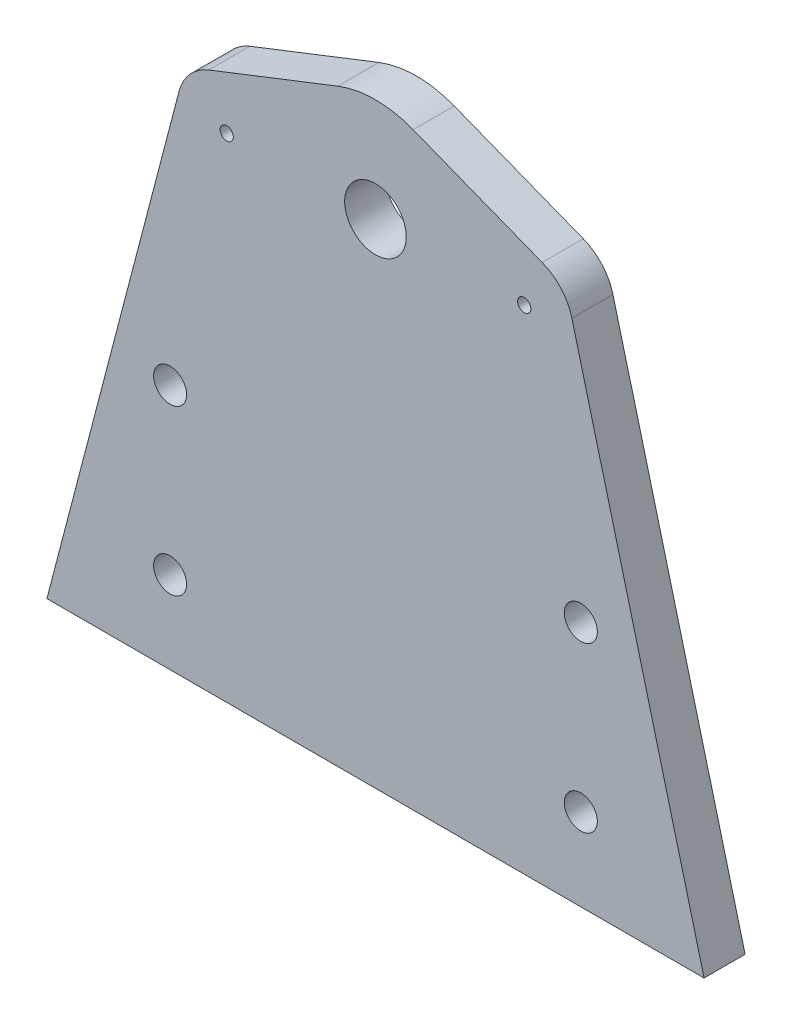
ISO-10303-21;
HEADER;
FILE_DESCRIPTION(('STEP AP214'),'2;1');
FILE_NAME('part.step','',(''),(''),'','','');
FILE_SCHEMA(('AUTOMOTIVE_DESIGN { 1 0 10303 214 1 1 1 1 }'));
ENDSEC;
DATA;
#1=APPLICATION_CONTEXT('core data for automotive mechanical design processes');
#2=APPLICATION_PROTOCOL_DEFINITION('international standard','automotive_design',2000,#1);
#3=PRODUCT_CONTEXT('',#1,'mechanical');
#4=PRODUCT('Part','Part','',(#3));
#5=PRODUCT_RELATED_PRODUCT_CATEGORY('part','',(#4));
#6=PRODUCT_DEFINITION_FORMATION('','',#4);
#7=PRODUCT_DEFINITION_CONTEXT('part definition',#1,'design');
#8=PRODUCT_DEFINITION('design','',#6,#7);
#9=PRODUCT_DEFINITION_SHAPE('','',#8);
#10=(LENGTH_UNIT() NAMED_UNIT(*) SI_UNIT(.MILLI.,.METRE.));
#11=(NAMED_UNIT(*) PLANE_ANGLE_UNIT() SI_UNIT($,.RADIAN.));
#12=(NAMED_UNIT(*) SI_UNIT($,.STERADIAN.) SOLID_ANGLE_UNIT());
#13=UNCERTAINTY_MEASURE_WITH_UNIT(LENGTH_MEASURE(1.E-05),#10,'distance_accuracy_value','');
#14=(GEOMETRIC_REPRESENTATION_CONTEXT(3) GLOBAL_UNCERTAINTY_ASSIGNED_CONTEXT((#13)) GLOBAL_UNIT_ASSIGNED_CONTEXT((#10,
#11,#12)) REPRESENTATION_CONTEXT('',''));
#15=CARTESIAN_POINT('',(0.,0.,0.));
#16=DIRECTION('',(0.,0.,1.));
#17=DIRECTION('',(1.,0.,0.));
#18=AXIS2_PLACEMENT_3D('',#15,#16,#17);
#19=CARTESIAN_POINT('',(0.,0.,6.35));
#20=DIRECTION('',(0.,0.,-1.));
#21=DIRECTION('',(-1.,0.,0.));
#22=AXIS2_PLACEMENT_3D('',#19,#20,#21);
#23=PLANE('',#22);
#24=CARTESIAN_POINT('',(-31.75,-38.1,6.35));
#25=DIRECTION('',(0.,0.,1.));
#26=DIRECTION('',(1.,0.,0.));
#27=AXIS2_PLACEMENT_3D('',#24,#25,#26);
#28=CIRCLE('',#27,2.5527);
#29=CARTESIAN_POINT('',(-29.1973,-38.1,6.35));
#30=VERTEX_POINT('',#29);
#31=EDGE_CURVE('E221',#30,#30,#28,.T.);
#32=ORIENTED_EDGE('',*,*,#31,.F.);
#33=EDGE_LOOP('',(#32));
#34=FACE_BOUND('',#33,.T.);
#35=CARTESIAN_POINT('',(0.,0.,6.35));
#36=DIRECTION('',(0.,0.,1.));
#37=DIRECTION('',(1.,0.,0.));
#38=AXIS2_PLACEMENT_3D('',#35,#36,#37);
#39=CIRCLE('',#38,4.7625);
#40=CARTESIAN_POINT('',(4.7625,0.,6.35));
#41=VERTEX_POINT('',#40);
#42=EDGE_CURVE('E138',#41,#41,#39,.T.);
#43=ORIENTED_EDGE('',*,*,#42,.F.);
#44=EDGE_LOOP('',(#43));
#45=FACE_BOUND('',#44,.T.);
#46=CARTESIAN_POINT('',(0.,0.,6.35));
#47=DIRECTION('',(0.,0.,1.));
#48=DIRECTION('',(-1.,0.,0.));
#49=AXIS2_PLACEMENT_3D('',#46,#47,#48);
#50=CIRCLE('',#49,16.);
#51=CARTESIAN_POINT('',(5.82956522398125,14.9002070220299,6.35));
#52=VERTEX_POINT('',#51);
#53=CARTESIAN_POINT('',(-5.82956522398125,14.9002070220299,6.35));
#54=VERTEX_POINT('',#53);
#55=EDGE_CURVE('E149',#52,#54,#50,.T.);
#56=ORIENTED_EDGE('',*,*,#55,.T.);
#57=DIRECTION('',(-0.931262938876867,-0.364347826498828,0.));
#58=VECTOR('',#57,1.);
#59=CARTESIAN_POINT('',(-25.7763304119211,7.09622359424173,6.35));
#60=LINE('',#59,#58);
#61=CARTESIAN_POINT('',(-25.7763304119211,7.09622359424173,6.35));
#62=VERTEX_POINT('',#61);
#63=EDGE_CURVE('E97',#54,#62,#60,.T.);
#64=ORIENTED_EDGE('',*,*,#63,.T.);
#65=CARTESIAN_POINT('',(-22.999999974,0.,6.35));
#66=DIRECTION('',(0.,0.,1.));
#67=DIRECTION('',(1.,0.,0.));
#68=AXIS2_PLACEMENT_3D('',#65,#66,#67);
#69=CIRCLE('',#68,7.62);
#70=CARTESIAN_POINT('',(-30.3721655240328,1.92758270974527,6.35));
#71=VERTEX_POINT('',#70);
#72=EDGE_CURVE('E164',#62,#71,#69,.T.);
#73=ORIENTED_EDGE('',*,*,#72,.T.);
#74=DIRECTION('',(-0.252963610202791,-0.967475793967565,0.));
#75=VECTOR('',#74,1.);
#76=CARTESIAN_POINT('',(-30.3721655240328,1.92758270974527,6.35));
#77=LINE('',#76,#75);
#78=CARTESIAN_POINT('',(-50.8,-76.2,6.35));
#79=VERTEX_POINT('',#78);
#80=EDGE_CURVE('E177',#71,#79,#77,.T.);
#81=ORIENTED_EDGE('',*,*,#80,.T.);
#82=DIRECTION('',(1.,0.,0.));
#83=VECTOR('',#82,1.);
#84=CARTESIAN_POINT('',(-50.8,-76.2,6.35));
#85=LINE('',#84,#83);
#86=CARTESIAN_POINT('',(50.8,-76.2,6.35));
#87=VERTEX_POINT('',#86);
#88=EDGE_CURVE('E116',#79,#87,#85,.T.);
#89=ORIENTED_EDGE('',*,*,#88,.T.);
#90=DIRECTION('',(-0.252963610202791,0.967475793967565,0.));
#91=VECTOR('',#90,1.);
#92=CARTESIAN_POINT('',(30.3721655240328,1.92758270974527,6.35));
#93=LINE('',#92,#91);
#94=CARTESIAN_POINT('',(30.3721655240328,1.92758270974527,6.35));
#95=VERTEX_POINT('',#94);
#96=EDGE_CURVE('E110',#87,#95,#93,.T.);
#97=ORIENTED_EDGE('',*,*,#96,.T.);
#98=CARTESIAN_POINT('',(22.999999974,0.,6.35));
#99=DIRECTION('',(0.,0.,1.));
#100=DIRECTION('',(-1.,0.,0.));
#101=AXIS2_PLACEMENT_3D('',#98,#99,#100);
#102=CIRCLE('',#101,7.62);
#103=CARTESIAN_POINT('',(25.7763304119211,7.09622359424172,6.35));
#104=VERTEX_POINT('',#103);
#105=EDGE_CURVE('E114',#95,#104,#102,.T.);
#106=ORIENTED_EDGE('',*,*,#105,.T.);
#107=DIRECTION('',(-0.931262938876867,0.364347826498828,0.));
#108=VECTOR('',#107,1.);
#109=CARTESIAN_POINT('',(5.82956522398125,14.9002070220299,6.35));
#110=LINE('',#109,#108);
#111=EDGE_CURVE('E54',#104,#52,#110,.T.);
#112=ORIENTED_EDGE('',*,*,#111,.T.);
#113=EDGE_LOOP('',(#56,#64,#73,#81,#89,#97,#106,#112));
#114=FACE_BOUND('',#113,.T.);
#115=CARTESIAN_POINT('',(-22.999999974,0.,6.35));
#116=DIRECTION('',(0.,0.,-1.));
#117=DIRECTION('',(-1.,0.,0.));
#118=AXIS2_PLACEMENT_3D('',#115,#116,#117);
#119=CIRCLE('',#118,1.025);
#120=CARTESIAN_POINT('',(-24.024999974,0.,6.35));
#121=VERTEX_POINT('',#120);
#122=EDGE_CURVE('E186',#121,#121,#119,.T.);
#123=ORIENTED_EDGE('',*,*,#122,.T.);
#124=EDGE_LOOP('',(#123));
#125=FACE_BOUND('',#124,.T.);
#126=CARTESIAN_POINT('',(22.999999974,0.,6.35));
#127=DIRECTION('',(0.,0.,-1.));
#128=DIRECTION('',(-1.,0.,0.));
#129=AXIS2_PLACEMENT_3D('',#126,#127,#128);
#130=CIRCLE('',#129,1.025);
#131=CARTESIAN_POINT('',(21.974999974,0.,6.35));
#132=VERTEX_POINT('',#131);
#133=EDGE_CURVE('E194',#132,#132,#130,.T.);
#134=ORIENTED_EDGE('',*,*,#133,.T.);
#135=EDGE_LOOP('',(#134));
#136=FACE_BOUND('',#135,.T.);
#137=CARTESIAN_POINT('',(31.75,-38.1,6.35));
#138=DIRECTION('',(0.,0.,1.));
#139=DIRECTION('',(1.,0.,0.));
#140=AXIS2_PLACEMENT_3D('',#137,#138,#139);
#141=CIRCLE('',#140,2.5527);
#142=CARTESIAN_POINT('',(34.3027,-38.1,6.35));
#143=VERTEX_POINT('',#142);
#144=EDGE_CURVE('E203',#143,#143,#141,.T.);
#145=ORIENTED_EDGE('',*,*,#144,.F.);
#146=EDGE_LOOP('',(#145));
#147=FACE_BOUND('',#146,.T.);
#148=CARTESIAN_POINT('',(31.75,-63.5,6.35));
#149=DIRECTION('',(0.,0.,1.));
#150=DIRECTION('',(1.,0.,0.));
#151=AXIS2_PLACEMENT_3D('',#148,#149,#150);
#152=CIRCLE('',#151,2.5527);
#153=CARTESIAN_POINT('',(34.3027,-63.5,6.35));
#154=VERTEX_POINT('',#153);
#155=EDGE_CURVE('E209',#154,#154,#152,.T.);
#156=ORIENTED_EDGE('',*,*,#155,.F.);
#157=EDGE_LOOP('',(#156));
#158=FACE_BOUND('',#157,.T.);
#159=CARTESIAN_POINT('',(-31.75,-63.5,6.35));
#160=DIRECTION('',(0.,0.,1.));
#161=DIRECTION('',(1.,0.,0.));
#162=AXIS2_PLACEMENT_3D('',#159,#160,#161);
#163=CIRCLE('',#162,2.5527);
#164=CARTESIAN_POINT('',(-29.1973,-63.5,6.35));
#165=VERTEX_POINT('',#164);
#166=EDGE_CURVE('E215',#165,#165,#163,.T.);
#167=ORIENTED_EDGE('',*,*,#166,.F.);
#168=EDGE_LOOP('',(#167));
#169=FACE_BOUND('',#168,.T.);
#170=ADVANCED_FACE('F37',(#34,#45,#114,#125,#136,#147,#158,#169),#23,.F.);
#171=CARTESIAN_POINT('',(0.,0.,0.));
#172=DIRECTION('',(0.,0.,-1.));
#173=DIRECTION('',(-1.,0.,0.));
#174=AXIS2_PLACEMENT_3D('',#171,#172,#173);
#175=PLANE('',#174);
#176=CARTESIAN_POINT('',(-31.75,-38.1,0.));
#177=DIRECTION('',(0.,0.,1.));
#178=DIRECTION('',(1.,0.,0.));
#179=AXIS2_PLACEMENT_3D('',#176,#177,#178);
#180=CIRCLE('',#179,2.5527);
#181=CARTESIAN_POINT('',(-29.1973,-38.1,0.));
#182=VERTEX_POINT('',#181);
#183=EDGE_CURVE('E218',#182,#182,#180,.T.);
#184=ORIENTED_EDGE('',*,*,#183,.T.);
#185=EDGE_LOOP('',(#184));
#186=FACE_BOUND('',#185,.T.);
#187=CARTESIAN_POINT('',(0.,0.,0.));
#188=DIRECTION('',(0.,0.,1.));
#189=DIRECTION('',(1.,0.,0.));
#190=AXIS2_PLACEMENT_3D('',#187,#188,#189);
#191=CIRCLE('',#190,4.7625);
#192=CARTESIAN_POINT('',(4.7625,0.,0.));
#193=VERTEX_POINT('',#192);
#194=EDGE_CURVE('E183',#193,#193,#191,.T.);
#195=ORIENTED_EDGE('',*,*,#194,.T.);
#196=EDGE_LOOP('',(#195));
#197=FACE_BOUND('',#196,.T.);
#198=CARTESIAN_POINT('',(0.,0.,0.));
#199=DIRECTION('',(0.,0.,1.));
#200=DIRECTION('',(-1.,0.,0.));
#201=AXIS2_PLACEMENT_3D('',#198,#199,#200);
#202=CIRCLE('',#201,16.);
#203=CARTESIAN_POINT('',(5.82956522398125,14.9002070220299,0.));
#204=VERTEX_POINT('',#203);
#205=CARTESIAN_POINT('',(-5.82956522398125,14.9002070220299,0.));
#206=VERTEX_POINT('',#205);
#207=EDGE_CURVE('E134',#204,#206,#202,.T.);
#208=ORIENTED_EDGE('',*,*,#207,.F.);
#209=DIRECTION('',(-0.931262938876867,0.364347826498828,0.));
#210=VECTOR('',#209,1.);
#211=CARTESIAN_POINT('',(5.82956522398125,14.9002070220299,0.));
#212=LINE('',#211,#210);
#213=CARTESIAN_POINT('',(25.7763304119211,7.09622359424172,0.));
#214=VERTEX_POINT('',#213);
#215=EDGE_CURVE('E89',#214,#204,#212,.T.);
#216=ORIENTED_EDGE('',*,*,#215,.F.);
#217=CARTESIAN_POINT('',(22.999999974,0.,0.));
#218=DIRECTION('',(0.,0.,1.));
#219=DIRECTION('',(-1.,0.,0.));
#220=AXIS2_PLACEMENT_3D('',#217,#218,#219);
#221=CIRCLE('',#220,7.62);
#222=CARTESIAN_POINT('',(30.3721655240328,1.92758270974527,0.));
#223=VERTEX_POINT('',#222);
#224=EDGE_CURVE('E83',#223,#214,#221,.T.);
#225=ORIENTED_EDGE('',*,*,#224,.F.);
#226=DIRECTION('',(-0.252963610202791,0.967475793967565,0.));
#227=VECTOR('',#226,1.);
#228=CARTESIAN_POINT('',(30.3721655240328,1.92758270974527,0.));
#229=LINE('',#228,#227);
#230=CARTESIAN_POINT('',(50.8,-76.2,0.));
#231=VERTEX_POINT('',#230);
#232=EDGE_CURVE('E124',#231,#223,#229,.T.);
#233=ORIENTED_EDGE('',*,*,#232,.F.);
#234=DIRECTION('',(1.,0.,0.));
#235=VECTOR('',#234,1.);
#236=CARTESIAN_POINT('',(-50.8,-76.2,0.));
#237=LINE('',#236,#235);
#238=CARTESIAN_POINT('',(-50.8,-76.2,0.));
#239=VERTEX_POINT('',#238);
#240=EDGE_CURVE('E144',#239,#231,#237,.T.);
#241=ORIENTED_EDGE('',*,*,#240,.F.);
#242=DIRECTION('',(-0.252963610202791,-0.967475793967565,0.));
#243=VECTOR('',#242,1.);
#244=CARTESIAN_POINT('',(-30.3721655240328,1.92758270974527,0.));
#245=LINE('',#244,#243);
#246=CARTESIAN_POINT('',(-30.3721655240328,1.92758270974527,0.));
#247=VERTEX_POINT('',#246);
#248=EDGE_CURVE('E142',#247,#239,#245,.T.);
#249=ORIENTED_EDGE('',*,*,#248,.F.);
#250=CARTESIAN_POINT('',(-22.999999974,0.,0.));
#251=DIRECTION('',(0.,0.,1.));
#252=DIRECTION('',(1.,0.,0.));
#253=AXIS2_PLACEMENT_3D('',#250,#251,#252);
#254=CIRCLE('',#253,7.62);
#255=CARTESIAN_POINT('',(-25.7763304119211,7.09622359424173,0.));
#256=VERTEX_POINT('',#255);
#257=EDGE_CURVE('E140',#256,#247,#254,.T.);
#258=ORIENTED_EDGE('',*,*,#257,.F.);
#259=DIRECTION('',(-0.931262938876867,-0.364347826498828,0.));
#260=VECTOR('',#259,1.);
#261=CARTESIAN_POINT('',(-25.7763304119211,7.09622359424173,0.));
#262=LINE('',#261,#260);
#263=EDGE_CURVE('E137',#206,#256,#262,.T.);
#264=ORIENTED_EDGE('',*,*,#263,.F.);
#265=EDGE_LOOP('',(#208,#216,#225,#233,#241,#249,#258,#264));
#266=FACE_BOUND('',#265,.T.);
#267=CARTESIAN_POINT('',(-22.999999974,0.,0.));
#268=DIRECTION('',(0.,0.,-1.));
#269=DIRECTION('',(-1.,0.,0.));
#270=AXIS2_PLACEMENT_3D('',#267,#268,#269);
#271=CIRCLE('',#270,1.02499999999999);
#272=CARTESIAN_POINT('',(-24.024999974,0.,0.));
#273=VERTEX_POINT('',#272);
#274=EDGE_CURVE('E191',#273,#273,#271,.T.);
#275=ORIENTED_EDGE('',*,*,#274,.F.);
#276=EDGE_LOOP('',(#275));
#277=FACE_BOUND('',#276,.T.);
#278=CARTESIAN_POINT('',(22.999999974,0.,0.));
#279=DIRECTION('',(0.,0.,-1.));
#280=DIRECTION('',(-1.,0.,0.));
#281=AXIS2_PLACEMENT_3D('',#278,#279,#280);
#282=CIRCLE('',#281,1.02499999999999);
#283=CARTESIAN_POINT('',(21.974999974,0.,0.));
#284=VERTEX_POINT('',#283);
#285=EDGE_CURVE('E197',#284,#284,#282,.T.);
#286=ORIENTED_EDGE('',*,*,#285,.F.);
#287=EDGE_LOOP('',(#286));
#288=FACE_BOUND('',#287,.T.);
#289=CARTESIAN_POINT('',(31.75,-38.1,0.));
#290=DIRECTION('',(0.,0.,1.));
#291=DIRECTION('',(1.,0.,0.));
#292=AXIS2_PLACEMENT_3D('',#289,#290,#291);
#293=CIRCLE('',#292,2.5527);
#294=CARTESIAN_POINT('',(34.3027,-38.1,0.));
#295=VERTEX_POINT('',#294);
#296=EDGE_CURVE('E200',#295,#295,#293,.T.);
#297=ORIENTED_EDGE('',*,*,#296,.T.);
#298=EDGE_LOOP('',(#297));
#299=FACE_BOUND('',#298,.T.);
#300=CARTESIAN_POINT('',(31.75,-63.5,0.));
#301=DIRECTION('',(0.,0.,1.));
#302=DIRECTION('',(1.,0.,0.));
#303=AXIS2_PLACEMENT_3D('',#300,#301,#302);
#304=CIRCLE('',#303,2.5527);
#305=CARTESIAN_POINT('',(34.3027,-63.5,0.));
#306=VERTEX_POINT('',#305);
#307=EDGE_CURVE('E206',#306,#306,#304,.T.);
#308=ORIENTED_EDGE('',*,*,#307,.T.);
#309=EDGE_LOOP('',(#308));
#310=FACE_BOUND('',#309,.T.);
#311=CARTESIAN_POINT('',(-31.75,-63.5,0.));
#312=DIRECTION('',(0.,0.,1.));
#313=DIRECTION('',(1.,0.,0.));
#314=AXIS2_PLACEMENT_3D('',#311,#312,#313);
#315=CIRCLE('',#314,2.5527);
#316=CARTESIAN_POINT('',(-29.1973,-63.5,0.));
#317=VERTEX_POINT('',#316);
#318=EDGE_CURVE('E212',#317,#317,#315,.T.);
#319=ORIENTED_EDGE('',*,*,#318,.T.);
#320=EDGE_LOOP('',(#319));
#321=FACE_BOUND('',#320,.T.);
#322=ADVANCED_FACE('F168',(#186,#197,#266,#277,#288,#299,#310,#321),#175,.T.);
#323=CARTESIAN_POINT('',(0.,0.,6.35));
#324=DIRECTION('',(0.,0.,-1.));
#325=DIRECTION('',(-1.,0.,0.));
#326=AXIS2_PLACEMENT_3D('',#323,#324,#325);
#327=CYLINDRICAL_SURFACE('',#326,16.);
#328=ORIENTED_EDGE('',*,*,#207,.T.);
#329=DIRECTION('',(0.,0.,-1.));
#330=VECTOR('',#329,1.);
#331=CARTESIAN_POINT('',(-5.82956522398125,14.9002070220299,6.35));
#332=LINE('',#331,#330);
#333=EDGE_CURVE('E11',#54,#206,#332,.T.);
#334=ORIENTED_EDGE('',*,*,#333,.F.);
#335=ORIENTED_EDGE('',*,*,#55,.F.);
#336=DIRECTION('',(0.,0.,-1.));
#337=VECTOR('',#336,1.);
#338=CARTESIAN_POINT('',(5.82956522398125,14.9002070220299,6.35));
#339=LINE('',#338,#337);
#340=EDGE_CURVE('E130',#52,#204,#339,.T.);
#341=ORIENTED_EDGE('',*,*,#340,.T.);
#342=EDGE_LOOP('',(#328,#334,#335,#341));
#343=FACE_BOUND('',#342,.T.);
#344=ADVANCED_FACE('F39',(#343),#327,.T.);
#345=CARTESIAN_POINT('',(-25.7763304119211,7.09622359424173,6.35));
#346=DIRECTION('',(0.364347826498828,-0.931262938876867,0.));
#347=DIRECTION('',(0.931262938876867,0.364347826498828,0.));
#348=AXIS2_PLACEMENT_3D('',#345,#346,#347);
#349=PLANE('',#348);
#350=ORIENTED_EDGE('',*,*,#263,.T.);
#351=DIRECTION('',(0.,0.,-1.));
#352=VECTOR('',#351,1.);
#353=CARTESIAN_POINT('',(-25.7763304119211,7.09622359424173,6.35));
#354=LINE('',#353,#352);
#355=EDGE_CURVE('E46',#62,#256,#354,.T.);
#356=ORIENTED_EDGE('',*,*,#355,.F.);
#357=ORIENTED_EDGE('',*,*,#63,.F.);
#358=ORIENTED_EDGE('',*,*,#333,.T.);
#359=EDGE_LOOP('',(#350,#356,#357,#358));
#360=FACE_BOUND('',#359,.T.);
#361=ADVANCED_FACE('F246',(#360),#349,.F.);
#362=CARTESIAN_POINT('',(-22.999999974,0.,6.35));
#363=DIRECTION('',(0.,0.,-1.));
#364=DIRECTION('',(-1.,0.,0.));
#365=AXIS2_PLACEMENT_3D('',#362,#363,#364);
#366=CYLINDRICAL_SURFACE('',#365,7.62);
#367=ORIENTED_EDGE('',*,*,#257,.T.);
#368=DIRECTION('',(0.,0.,-1.));
#369=VECTOR('',#368,1.);
#370=CARTESIAN_POINT('',(-30.3721655240328,1.92758270974527,6.35));
#371=LINE('',#370,#369);
#372=EDGE_CURVE('E156',#71,#247,#371,.T.);
#373=ORIENTED_EDGE('',*,*,#372,.F.);
#374=ORIENTED_EDGE('',*,*,#72,.F.);
#375=ORIENTED_EDGE('',*,*,#355,.T.);
#376=EDGE_LOOP('',(#367,#373,#374,#375));
#377=FACE_BOUND('',#376,.T.);
#378=ADVANCED_FACE('F162',(#377),#366,.T.);
#379=CARTESIAN_POINT('',(-30.3721655240328,1.92758270974527,6.35));
#380=DIRECTION('',(0.967475793967565,-0.252963610202791,0.));
#381=DIRECTION('',(0.252963610202791,0.967475793967565,0.));
#382=AXIS2_PLACEMENT_3D('',#379,#380,#381);
#383=PLANE('',#382);
#384=ORIENTED_EDGE('',*,*,#248,.T.);
#385=DIRECTION('',(0.,0.,-1.));
#386=VECTOR('',#385,1.);
#387=CARTESIAN_POINT('',(-50.8,-76.2,6.35));
#388=LINE('',#387,#386);
#389=EDGE_CURVE('E153',#79,#239,#388,.T.);
#390=ORIENTED_EDGE('',*,*,#389,.F.);
#391=ORIENTED_EDGE('',*,*,#80,.F.);
#392=ORIENTED_EDGE('',*,*,#372,.T.);
#393=EDGE_LOOP('',(#384,#390,#391,#392));
#394=FACE_BOUND('',#393,.T.);
#395=ADVANCED_FACE('F173',(#394),#383,.F.);
#396=CARTESIAN_POINT('',(-50.8,-76.2,6.35));
#397=DIRECTION('',(0.,1.,0.));
#398=DIRECTION('',(-1.,0.,0.));
#399=AXIS2_PLACEMENT_3D('',#396,#397,#398);
#400=PLANE('',#399);
#401=ORIENTED_EDGE('',*,*,#240,.T.);
#402=DIRECTION('',(0.,0.,-1.));
#403=VECTOR('',#402,1.);
#404=CARTESIAN_POINT('',(50.8,-76.2,6.35));
#405=LINE('',#404,#403);
#406=EDGE_CURVE('E125',#87,#231,#405,.T.);
#407=ORIENTED_EDGE('',*,*,#406,.F.);
#408=ORIENTED_EDGE('',*,*,#88,.F.);
#409=ORIENTED_EDGE('',*,*,#389,.T.);
#410=EDGE_LOOP('',(#401,#407,#408,#409));
#411=FACE_BOUND('',#410,.T.);
#412=ADVANCED_FACE('F176',(#411),#400,.F.);
#413=CARTESIAN_POINT('',(30.3721655240328,1.92758270974527,6.35));
#414=DIRECTION('',(-0.967475793967565,-0.252963610202791,0.));
#415=DIRECTION('',(0.252963610202791,-0.967475793967565,0.));
#416=AXIS2_PLACEMENT_3D('',#413,#414,#415);
#417=PLANE('',#416);
#418=ORIENTED_EDGE('',*,*,#232,.T.);
#419=DIRECTION('',(0.,0.,-1.));
#420=VECTOR('',#419,1.);
#421=CARTESIAN_POINT('',(30.3721655240328,1.92758270974527,6.35));
#422=LINE('',#421,#420);
#423=EDGE_CURVE('E121',#95,#223,#422,.T.);
#424=ORIENTED_EDGE('',*,*,#423,.F.);
#425=ORIENTED_EDGE('',*,*,#96,.F.);
#426=ORIENTED_EDGE('',*,*,#406,.T.);
#427=EDGE_LOOP('',(#418,#424,#425,#426));
#428=FACE_BOUND('',#427,.T.);
#429=ADVANCED_FACE('F122',(#428),#417,.F.);
#430=CARTESIAN_POINT('',(22.999999974,0.,6.35));
#431=DIRECTION('',(0.,0.,-1.));
#432=DIRECTION('',(-1.,0.,0.));
#433=AXIS2_PLACEMENT_3D('',#430,#431,#432);
#434=CYLINDRICAL_SURFACE('',#433,7.62);
#435=ORIENTED_EDGE('',*,*,#224,.T.);
#436=DIRECTION('',(0.,0.,-1.));
#437=VECTOR('',#436,1.);
#438=CARTESIAN_POINT('',(25.7763304119211,7.09622359424172,6.35));
#439=LINE('',#438,#437);
#440=EDGE_CURVE('E126',#104,#214,#439,.T.);
#441=ORIENTED_EDGE('',*,*,#440,.F.);
#442=ORIENTED_EDGE('',*,*,#105,.F.);
#443=ORIENTED_EDGE('',*,*,#423,.T.);
#444=EDGE_LOOP('',(#435,#441,#442,#443));
#445=FACE_BOUND('',#444,.T.);
#446=ADVANCED_FACE('F128',(#445),#434,.T.);
#447=CARTESIAN_POINT('',(5.82956522398125,14.9002070220299,6.35));
#448=DIRECTION('',(-0.364347826498828,-0.931262938876867,0.));
#449=DIRECTION('',(0.931262938876868,-0.364347826498828,0.));
#450=AXIS2_PLACEMENT_3D('',#447,#448,#449);
#451=PLANE('',#450);
#452=ORIENTED_EDGE('',*,*,#215,.T.);
#453=ORIENTED_EDGE('',*,*,#340,.F.);
#454=ORIENTED_EDGE('',*,*,#111,.F.);
#455=ORIENTED_EDGE('',*,*,#440,.T.);
#456=EDGE_LOOP('',(#452,#453,#454,#455));
#457=FACE_BOUND('',#456,.T.);
#458=ADVANCED_FACE('F236',(#457),#451,.F.);
#459=CARTESIAN_POINT('',(0.,0.,6.35));
#460=DIRECTION('',(0.,0.,-1.));
#461=DIRECTION('',(-1.,0.,0.));
#462=AXIS2_PLACEMENT_3D('',#459,#460,#461);
#463=CYLINDRICAL_SURFACE('',#462,4.7625);
#464=ORIENTED_EDGE('',*,*,#42,.T.);
#465=EDGE_LOOP('',(#464));
#466=FACE_BOUND('',#465,.T.);
#467=ORIENTED_EDGE('',*,*,#194,.F.);
#468=EDGE_LOOP('',(#467));
#469=FACE_BOUND('',#468,.T.);
#470=ADVANCED_FACE('F232',(#466,#469),#463,.F.);
#471=CARTESIAN_POINT('',(-22.999999974,0.,0.));
#472=DIRECTION('',(0.,0.,-1.));
#473=DIRECTION('',(-1.,0.,0.));
#474=AXIS2_PLACEMENT_3D('',#471,#472,#473);
#475=CYLINDRICAL_SURFACE('',#474,1.02499999999999);
#476=ORIENTED_EDGE('',*,*,#122,.F.);
#477=EDGE_LOOP('',(#476));
#478=FACE_BOUND('',#477,.T.);
#479=ORIENTED_EDGE('',*,*,#274,.T.);
#480=EDGE_LOOP('',(#479));
#481=FACE_BOUND('',#480,.T.);
#482=ADVANCED_FACE('F235',(#478,#481),#475,.F.);
#483=CARTESIAN_POINT('',(22.999999974,0.,0.));
#484=DIRECTION('',(0.,0.,-1.));
#485=DIRECTION('',(-1.,0.,0.));
#486=AXIS2_PLACEMENT_3D('',#483,#484,#485);
#487=CYLINDRICAL_SURFACE('',#486,1.02499999999999);
#488=ORIENTED_EDGE('',*,*,#133,.F.);
#489=EDGE_LOOP('',(#488));
#490=FACE_BOUND('',#489,.T.);
#491=ORIENTED_EDGE('',*,*,#285,.T.);
#492=EDGE_LOOP('',(#491));
#493=FACE_BOUND('',#492,.T.);
#494=ADVANCED_FACE('F300',(#490,#493),#487,.F.);
#495=CARTESIAN_POINT('',(31.75,-38.1,6.35));
#496=DIRECTION('',(0.,0.,1.));
#497=DIRECTION('',(1.,0.,0.));
#498=AXIS2_PLACEMENT_3D('',#495,#496,#497);
#499=CYLINDRICAL_SURFACE('',#498,2.5527);
#500=ORIENTED_EDGE('',*,*,#296,.F.);
#501=EDGE_LOOP('',(#500));
#502=FACE_BOUND('',#501,.T.);
#503=ORIENTED_EDGE('',*,*,#144,.T.);
#504=EDGE_LOOP('',(#503));
#505=FACE_BOUND('',#504,.T.);
#506=ADVANCED_FACE('F308',(#502,#505),#499,.F.);
#507=CARTESIAN_POINT('',(31.75,-63.5,6.35));
#508=DIRECTION('',(0.,0.,1.));
#509=DIRECTION('',(1.,0.,0.));
#510=AXIS2_PLACEMENT_3D('',#507,#508,#509);
#511=CYLINDRICAL_SURFACE('',#510,2.5527);
#512=ORIENTED_EDGE('',*,*,#307,.F.);
#513=EDGE_LOOP('',(#512));
#514=FACE_BOUND('',#513,.T.);
#515=ORIENTED_EDGE('',*,*,#155,.T.);
#516=EDGE_LOOP('',(#515));
#517=FACE_BOUND('',#516,.T.);
#518=ADVANCED_FACE('F317',(#514,#517),#511,.F.);
#519=CARTESIAN_POINT('',(-31.75,-63.5,6.35));
#520=DIRECTION('',(0.,0.,1.));
#521=DIRECTION('',(1.,0.,0.));
#522=AXIS2_PLACEMENT_3D('',#519,#520,#521);
#523=CYLINDRICAL_SURFACE('',#522,2.5527);
#524=ORIENTED_EDGE('',*,*,#318,.F.);
#525=EDGE_LOOP('',(#524));
#526=FACE_BOUND('',#525,.T.);
#527=ORIENTED_EDGE('',*,*,#166,.T.);
#528=EDGE_LOOP('',(#527));
#529=FACE_BOUND('',#528,.T.);
#530=ADVANCED_FACE('F325',(#526,#529),#523,.F.);
#531=CARTESIAN_POINT('',(-31.75,-38.1,6.35));
#532=DIRECTION('',(0.,0.,1.));
#533=DIRECTION('',(1.,0.,0.));
#534=AXIS2_PLACEMENT_3D('',#531,#532,#533);
#535=CYLINDRICAL_SURFACE('',#534,2.5527);
#536=ORIENTED_EDGE('',*,*,#183,.F.);
#537=EDGE_LOOP('',(#536));
#538=FACE_BOUND('',#537,.T.);
#539=ORIENTED_EDGE('',*,*,#31,.T.);
#540=EDGE_LOOP('',(#539));
#541=FACE_BOUND('',#540,.T.);
#542=ADVANCED_FACE('F225',(#538,#541),#535,.F.);
#543=CLOSED_SHELL('',(#170,#322,#344,#361,#378,#395,#412,#429,#446,#458,#470,#482,#494,#506,
#518,#530,#542));
#544=MANIFOLD_SOLID_BREP('B2',#543);
#545=ADVANCED_BREP_SHAPE_REPRESENTATION('',(#18,#544),#14);
#546=SHAPE_DEFINITION_REPRESENTATION(#9,#545);
ENDSEC;
END-ISO-10303-21;
